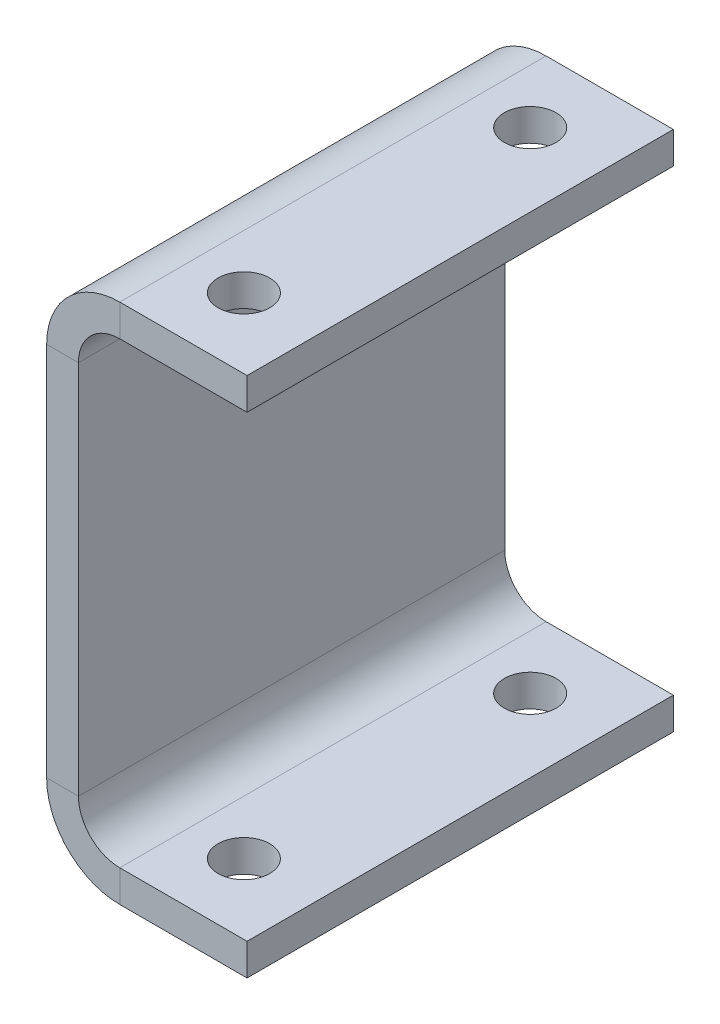
ISO-10303-21;
HEADER;
FILE_DESCRIPTION(('STEP AP214'),'2;1');
FILE_NAME('part.step','',(''),(''),'','','');
FILE_SCHEMA(('AUTOMOTIVE_DESIGN { 1 0 10303 214 1 1 1 1 }'));
ENDSEC;
DATA;
#1=APPLICATION_CONTEXT('core data for automotive mechanical design processes');
#2=APPLICATION_PROTOCOL_DEFINITION('international standard','automotive_design',2000,#1);
#3=PRODUCT_CONTEXT('',#1,'mechanical');
#4=PRODUCT('Part','Part','',(#3));
#5=PRODUCT_RELATED_PRODUCT_CATEGORY('part','',(#4));
#6=PRODUCT_DEFINITION_FORMATION('','',#4);
#7=PRODUCT_DEFINITION_CONTEXT('part definition',#1,'design');
#8=PRODUCT_DEFINITION('design','',#6,#7);
#9=PRODUCT_DEFINITION_SHAPE('','',#8);
#10=(LENGTH_UNIT() NAMED_UNIT(*) SI_UNIT(.MILLI.,.METRE.));
#11=(NAMED_UNIT(*) PLANE_ANGLE_UNIT() SI_UNIT($,.RADIAN.));
#12=(NAMED_UNIT(*) SI_UNIT($,.STERADIAN.) SOLID_ANGLE_UNIT());
#13=UNCERTAINTY_MEASURE_WITH_UNIT(LENGTH_MEASURE(1.E-05),#10,'distance_accuracy_value','');
#14=(GEOMETRIC_REPRESENTATION_CONTEXT(3) GLOBAL_UNCERTAINTY_ASSIGNED_CONTEXT((#13)) GLOBAL_UNIT_ASSIGNED_CONTEXT((#10,
#11,#12)) REPRESENTATION_CONTEXT('',''));
#15=CARTESIAN_POINT('',(0.,0.,0.));
#16=DIRECTION('',(0.,0.,1.));
#17=DIRECTION('',(1.,0.,0.));
#18=AXIS2_PLACEMENT_3D('',#15,#16,#17);
#19=CARTESIAN_POINT('',(0.,-59.,67.));
#20=DIRECTION('',(0.,0.,1.));
#21=DIRECTION('',(1.,0.,0.));
#22=AXIS2_PLACEMENT_3D('',#19,#20,#21);
#23=PLANE('',#22);
#24=DIRECTION('',(1.,0.,0.));
#25=VECTOR('',#24,1.);
#26=CARTESIAN_POINT('',(0.,-59.,67.));
#27=LINE('',#26,#25);
#28=CARTESIAN_POINT('',(0.,-59.,67.));
#29=VERTEX_POINT('',#28);
#30=CARTESIAN_POINT('',(10.,-59.,67.));
#31=VERTEX_POINT('',#30);
#32=EDGE_CURVE('E11',#29,#31,#27,.T.);
#33=ORIENTED_EDGE('',*,*,#32,.F.);
#34=CARTESIAN_POINT('',(23.,-59.,67.));
#35=DIRECTION('',(0.,0.,1.));
#36=DIRECTION('',(1.,0.,0.));
#37=AXIS2_PLACEMENT_3D('',#34,#35,#36);
#38=CIRCLE('',#37,23.);
#39=CARTESIAN_POINT('',(23.,-82.,67.));
#40=VERTEX_POINT('',#39);
#41=EDGE_CURVE('E269',#40,#29,#38,.F.);
#42=ORIENTED_EDGE('',*,*,#41,.F.);
#43=DIRECTION('',(0.,-1.,0.));
#44=VECTOR('',#43,1.);
#45=CARTESIAN_POINT('',(23.,-72.,67.));
#46=LINE('',#45,#44);
#47=CARTESIAN_POINT('',(23.,-72.,67.));
#48=VERTEX_POINT('',#47);
#49=EDGE_CURVE('E48',#48,#40,#46,.T.);
#50=ORIENTED_EDGE('',*,*,#49,.F.);
#51=CARTESIAN_POINT('',(23.,-59.,67.));
#52=DIRECTION('',(0.,0.,1.));
#53=DIRECTION('',(1.,0.,0.));
#54=AXIS2_PLACEMENT_3D('',#51,#52,#53);
#55=CIRCLE('',#54,13.);
#56=EDGE_CURVE('E150',#48,#31,#55,.F.);
#57=ORIENTED_EDGE('',*,*,#56,.T.);
#58=EDGE_LOOP('',(#33,#42,#50,#57));
#59=FACE_BOUND('',#58,.T.);
#60=ADVANCED_FACE('F39',(#59),#23,.T.);
#61=CARTESIAN_POINT('',(23.,-72.,67.));
#62=DIRECTION('',(0.,0.,1.));
#63=DIRECTION('',(1.,0.,0.));
#64=AXIS2_PLACEMENT_3D('',#61,#62,#63);
#65=PLANE('',#64);
#66=DIRECTION('',(0.,1.,0.));
#67=VECTOR('',#66,1.);
#68=CARTESIAN_POINT('',(0.,82.,67.));
#69=LINE('',#68,#67);
#70=CARTESIAN_POINT('',(0.,59.,67.));
#71=VERTEX_POINT('',#70);
#72=EDGE_CURVE('E144',#29,#71,#69,.T.);
#73=ORIENTED_EDGE('',*,*,#72,.F.);
#74=ORIENTED_EDGE('',*,*,#32,.T.);
#75=DIRECTION('',(0.,1.,0.));
#76=VECTOR('',#75,1.);
#77=CARTESIAN_POINT('',(9.99999999999997,82.,67.));
#78=LINE('',#77,#76);
#79=CARTESIAN_POINT('',(9.99999999999997,59.,67.));
#80=VERTEX_POINT('',#79);
#81=EDGE_CURVE('E141',#31,#80,#78,.T.);
#82=ORIENTED_EDGE('',*,*,#81,.T.);
#83=DIRECTION('',(-1.,0.,0.));
#84=VECTOR('',#83,1.);
#85=CARTESIAN_POINT('',(9.99999999999997,59.,67.));
#86=LINE('',#85,#84);
#87=EDGE_CURVE('E233',#80,#71,#86,.T.);
#88=ORIENTED_EDGE('',*,*,#87,.T.);
#89=EDGE_LOOP('',(#73,#74,#82,#88));
#90=FACE_BOUND('',#89,.T.);
#91=ADVANCED_FACE('F139',(#90),#65,.T.);
#92=CARTESIAN_POINT('',(23.,-82.,-67.));
#93=DIRECTION('',(0.,0.,-1.));
#94=DIRECTION('',(-1.,0.,0.));
#95=AXIS2_PLACEMENT_3D('',#92,#93,#94);
#96=PLANE('',#95);
#97=DIRECTION('',(0.,1.,0.));
#98=VECTOR('',#97,1.);
#99=CARTESIAN_POINT('',(23.,-82.,-67.));
#100=LINE('',#99,#98);
#101=CARTESIAN_POINT('',(23.,-82.,-67.));
#102=VERTEX_POINT('',#101);
#103=CARTESIAN_POINT('',(23.,-72.,-67.));
#104=VERTEX_POINT('',#103);
#105=EDGE_CURVE('E238',#102,#104,#100,.T.);
#106=ORIENTED_EDGE('',*,*,#105,.F.);
#107=CARTESIAN_POINT('',(23.,-59.,-67.));
#108=DIRECTION('',(0.,0.,1.));
#109=DIRECTION('',(1.,0.,0.));
#110=AXIS2_PLACEMENT_3D('',#107,#108,#109);
#111=CIRCLE('',#110,23.);
#112=CARTESIAN_POINT('',(0.,-59.,-67.));
#113=VERTEX_POINT('',#112);
#114=EDGE_CURVE('E190',#102,#113,#111,.F.);
#115=ORIENTED_EDGE('',*,*,#114,.T.);
#116=DIRECTION('',(-1.,0.,0.));
#117=VECTOR('',#116,1.);
#118=CARTESIAN_POINT('',(10.,-59.,-67.));
#119=LINE('',#118,#117);
#120=CARTESIAN_POINT('',(10.,-59.,-67.));
#121=VERTEX_POINT('',#120);
#122=EDGE_CURVE('E236',#121,#113,#119,.T.);
#123=ORIENTED_EDGE('',*,*,#122,.F.);
#124=CARTESIAN_POINT('',(23.,-59.,-67.));
#125=DIRECTION('',(0.,0.,1.));
#126=DIRECTION('',(1.,0.,0.));
#127=AXIS2_PLACEMENT_3D('',#124,#125,#126);
#128=CIRCLE('',#127,13.);
#129=EDGE_CURVE('E162',#104,#121,#128,.F.);
#130=ORIENTED_EDGE('',*,*,#129,.F.);
#131=EDGE_LOOP('',(#106,#115,#123,#130));
#132=FACE_BOUND('',#131,.T.);
#133=ADVANCED_FACE('F287',(#132),#96,.T.);
#134=CARTESIAN_POINT('',(10.,-59.,-67.));
#135=DIRECTION('',(0.,0.,-1.));
#136=DIRECTION('',(-1.,0.,0.));
#137=AXIS2_PLACEMENT_3D('',#134,#135,#136);
#138=PLANE('',#137);
#139=DIRECTION('',(-1.,0.,0.));
#140=VECTOR('',#139,1.);
#141=CARTESIAN_POINT('',(0.,-82.,-67.));
#142=LINE('',#141,#140);
#143=CARTESIAN_POINT('',(63.,-82.,-67.));
#144=VERTEX_POINT('',#143);
#145=EDGE_CURVE('E193',#144,#102,#142,.T.);
#146=ORIENTED_EDGE('',*,*,#145,.T.);
#147=ORIENTED_EDGE('',*,*,#105,.T.);
#148=DIRECTION('',(-1.,0.,0.));
#149=VECTOR('',#148,1.);
#150=CARTESIAN_POINT('',(0.,-72.,-67.));
#151=LINE('',#150,#149);
#152=CARTESIAN_POINT('',(63.,-72.,-67.));
#153=VERTEX_POINT('',#152);
#154=EDGE_CURVE('E199',#153,#104,#151,.T.);
#155=ORIENTED_EDGE('',*,*,#154,.F.);
#156=DIRECTION('',(0.,-1.,0.));
#157=VECTOR('',#156,1.);
#158=CARTESIAN_POINT('',(63.,-72.,-67.));
#159=LINE('',#158,#157);
#160=EDGE_CURVE('E196',#153,#144,#159,.T.);
#161=ORIENTED_EDGE('',*,*,#160,.T.);
#162=EDGE_LOOP('',(#146,#147,#155,#161));
#163=FACE_BOUND('',#162,.T.);
#164=ADVANCED_FACE('F335',(#163),#138,.T.);
#165=CARTESIAN_POINT('',(23.,82.,67.));
#166=DIRECTION('',(0.,0.,1.));
#167=DIRECTION('',(1.,0.,0.));
#168=AXIS2_PLACEMENT_3D('',#165,#166,#167);
#169=PLANE('',#168);
#170=DIRECTION('',(0.,-1.,0.));
#171=VECTOR('',#170,1.);
#172=CARTESIAN_POINT('',(23.,82.,67.));
#173=LINE('',#172,#171);
#174=CARTESIAN_POINT('',(23.,82.,67.));
#175=VERTEX_POINT('',#174);
#176=CARTESIAN_POINT('',(23.,72.,67.));
#177=VERTEX_POINT('',#176);
#178=EDGE_CURVE('E57',#175,#177,#173,.T.);
#179=ORIENTED_EDGE('',*,*,#178,.F.);
#180=CARTESIAN_POINT('',(23.,59.,67.));
#181=DIRECTION('',(0.,0.,1.));
#182=DIRECTION('',(1.,0.,0.));
#183=AXIS2_PLACEMENT_3D('',#180,#181,#182);
#184=CIRCLE('',#183,23.);
#185=EDGE_CURVE('E265',#71,#175,#184,.F.);
#186=ORIENTED_EDGE('',*,*,#185,.F.);
#187=ORIENTED_EDGE('',*,*,#87,.F.);
#188=CARTESIAN_POINT('',(23.,59.,67.));
#189=DIRECTION('',(0.,0.,1.));
#190=DIRECTION('',(1.,0.,0.));
#191=AXIS2_PLACEMENT_3D('',#188,#189,#190);
#192=CIRCLE('',#191,13.);
#193=EDGE_CURVE('E170',#80,#177,#192,.F.);
#194=ORIENTED_EDGE('',*,*,#193,.T.);
#195=EDGE_LOOP('',(#179,#186,#187,#194));
#196=FACE_BOUND('',#195,.T.);
#197=ADVANCED_FACE('F340',(#196),#169,.T.);
#198=CARTESIAN_POINT('',(9.99999999999997,59.,67.));
#199=DIRECTION('',(0.,0.,1.));
#200=DIRECTION('',(1.,0.,0.));
#201=AXIS2_PLACEMENT_3D('',#198,#199,#200);
#202=PLANE('',#201);
#203=DIRECTION('',(1.,0.,0.));
#204=VECTOR('',#203,1.);
#205=CARTESIAN_POINT('',(0.,82.,67.));
#206=LINE('',#205,#204);
#207=CARTESIAN_POINT('',(63.,82.,67.));
#208=VERTEX_POINT('',#207);
#209=EDGE_CURVE('E262',#175,#208,#206,.T.);
#210=ORIENTED_EDGE('',*,*,#209,.F.);
#211=ORIENTED_EDGE('',*,*,#178,.T.);
#212=DIRECTION('',(1.,0.,0.));
#213=VECTOR('',#212,1.);
#214=CARTESIAN_POINT('',(0.,72.,67.));
#215=LINE('',#214,#213);
#216=CARTESIAN_POINT('',(63.,72.0000000000001,67.));
#217=VERTEX_POINT('',#216);
#218=EDGE_CURVE('E111',#177,#217,#215,.T.);
#219=ORIENTED_EDGE('',*,*,#218,.T.);
#220=DIRECTION('',(0.,-1.,0.));
#221=VECTOR('',#220,1.);
#222=CARTESIAN_POINT('',(63.,82.,67.));
#223=LINE('',#222,#221);
#224=EDGE_CURVE('E259',#208,#217,#223,.T.);
#225=ORIENTED_EDGE('',*,*,#224,.F.);
#226=EDGE_LOOP('',(#210,#211,#219,#225));
#227=FACE_BOUND('',#226,.T.);
#228=ADVANCED_FACE('F314',(#227),#202,.T.);
#229=CARTESIAN_POINT('',(0.,59.,-67.));
#230=DIRECTION('',(0.,0.,-1.));
#231=DIRECTION('',(-1.,0.,0.));
#232=AXIS2_PLACEMENT_3D('',#229,#230,#231);
#233=PLANE('',#232);
#234=DIRECTION('',(1.,0.,0.));
#235=VECTOR('',#234,1.);
#236=CARTESIAN_POINT('',(0.,59.,-67.));
#237=LINE('',#236,#235);
#238=CARTESIAN_POINT('',(0.,59.,-67.));
#239=VERTEX_POINT('',#238);
#240=CARTESIAN_POINT('',(9.99999999999997,59.,-67.));
#241=VERTEX_POINT('',#240);
#242=EDGE_CURVE('E98',#239,#241,#237,.T.);
#243=ORIENTED_EDGE('',*,*,#242,.F.);
#244=CARTESIAN_POINT('',(23.,59.,-67.));
#245=DIRECTION('',(0.,0.,1.));
#246=DIRECTION('',(1.,0.,0.));
#247=AXIS2_PLACEMENT_3D('',#244,#245,#246);
#248=CIRCLE('',#247,23.);
#249=CARTESIAN_POINT('',(23.,82.,-67.));
#250=VERTEX_POINT('',#249);
#251=EDGE_CURVE('E186',#239,#250,#248,.F.);
#252=ORIENTED_EDGE('',*,*,#251,.T.);
#253=DIRECTION('',(0.,1.,0.));
#254=VECTOR('',#253,1.);
#255=CARTESIAN_POINT('',(23.,72.,-67.));
#256=LINE('',#255,#254);
#257=CARTESIAN_POINT('',(23.,72.,-67.));
#258=VERTEX_POINT('',#257);
#259=EDGE_CURVE('E105',#258,#250,#256,.T.);
#260=ORIENTED_EDGE('',*,*,#259,.F.);
#261=CARTESIAN_POINT('',(23.,59.,-67.));
#262=DIRECTION('',(0.,0.,1.));
#263=DIRECTION('',(1.,0.,0.));
#264=AXIS2_PLACEMENT_3D('',#261,#262,#263);
#265=CIRCLE('',#264,13.);
#266=EDGE_CURVE('E205',#241,#258,#265,.F.);
#267=ORIENTED_EDGE('',*,*,#266,.F.);
#268=EDGE_LOOP('',(#243,#252,#260,#267));
#269=FACE_BOUND('',#268,.T.);
#270=ADVANCED_FACE('F302',(#269),#233,.T.);
#271=CARTESIAN_POINT('',(23.,72.,-67.));
#272=DIRECTION('',(0.,0.,-1.));
#273=DIRECTION('',(-1.,0.,0.));
#274=AXIS2_PLACEMENT_3D('',#271,#272,#273);
#275=PLANE('',#274);
#276=DIRECTION('',(0.,1.,0.));
#277=VECTOR('',#276,1.);
#278=CARTESIAN_POINT('',(0.,82.,-67.));
#279=LINE('',#278,#277);
#280=EDGE_CURVE('E188',#113,#239,#279,.T.);
#281=ORIENTED_EDGE('',*,*,#280,.T.);
#282=ORIENTED_EDGE('',*,*,#242,.T.);
#283=DIRECTION('',(0.,1.,0.));
#284=VECTOR('',#283,1.);
#285=CARTESIAN_POINT('',(9.99999999999997,82.,-67.));
#286=LINE('',#285,#284);
#287=EDGE_CURVE('E203',#121,#241,#286,.T.);
#288=ORIENTED_EDGE('',*,*,#287,.F.);
#289=ORIENTED_EDGE('',*,*,#122,.T.);
#290=EDGE_LOOP('',(#281,#282,#288,#289));
#291=FACE_BOUND('',#290,.T.);
#292=ADVANCED_FACE('F289',(#291),#275,.T.);
#293=CARTESIAN_POINT('',(0.,72.,67.));
#294=DIRECTION('',(0.,1.,0.));
#295=DIRECTION('',(-1.,0.,0.));
#296=AXIS2_PLACEMENT_3D('',#293,#294,#295);
#297=PLANE('',#296);
#298=CARTESIAN_POINT('',(39.9999999999999,72.,45.));
#299=DIRECTION('',(0.,1.,0.));
#300=DIRECTION('',(-1.,0.,0.));
#301=AXIS2_PLACEMENT_3D('',#298,#299,#300);
#302=CIRCLE('',#301,8.125);
#303=CARTESIAN_POINT('',(31.8749999999999,72.,45.));
#304=VERTEX_POINT('',#303);
#305=EDGE_CURVE('E253',#304,#304,#302,.T.);
#306=ORIENTED_EDGE('',*,*,#305,.T.);
#307=EDGE_LOOP('',(#306));
#308=FACE_BOUND('',#307,.T.);
#309=CARTESIAN_POINT('',(39.9999999999999,72.,-45.));
#310=DIRECTION('',(0.,1.,0.));
#311=DIRECTION('',(-1.,0.,0.));
#312=AXIS2_PLACEMENT_3D('',#309,#310,#311);
#313=CIRCLE('',#312,8.125);
#314=CARTESIAN_POINT('',(31.8749999999999,72.,-45.));
#315=VERTEX_POINT('',#314);
#316=EDGE_CURVE('E180',#315,#315,#313,.T.);
#317=ORIENTED_EDGE('',*,*,#316,.T.);
#318=EDGE_LOOP('',(#317));
#319=FACE_BOUND('',#318,.T.);
#320=DIRECTION('',(1.,0.,0.));
#321=VECTOR('',#320,1.);
#322=CARTESIAN_POINT('',(0.,72.,-67.));
#323=LINE('',#322,#321);
#324=CARTESIAN_POINT('',(63.,72.0000000000001,-67.));
#325=VERTEX_POINT('',#324);
#326=EDGE_CURVE('E176',#258,#325,#323,.T.);
#327=ORIENTED_EDGE('',*,*,#326,.T.);
#328=DIRECTION('',(0.,0.,-1.));
#329=VECTOR('',#328,1.);
#330=CARTESIAN_POINT('',(63.,72.0000000000001,67.));
#331=LINE('',#330,#329);
#332=EDGE_CURVE('E229',#217,#325,#331,.T.);
#333=ORIENTED_EDGE('',*,*,#332,.F.);
#334=ORIENTED_EDGE('',*,*,#218,.F.);
#335=DIRECTION('',(0.,0.,-1.));
#336=VECTOR('',#335,1.);
#337=CARTESIAN_POINT('',(23.,72.,67.));
#338=LINE('',#337,#336);
#339=EDGE_CURVE('E172',#177,#258,#338,.T.);
#340=ORIENTED_EDGE('',*,*,#339,.T.);
#341=EDGE_LOOP('',(#327,#333,#334,#340));
#342=FACE_BOUND('',#341,.T.);
#343=ADVANCED_FACE('F308',(#308,#319,#342),#297,.F.);
#344=CARTESIAN_POINT('',(63.,82.,67.));
#345=DIRECTION('',(1.,0.,0.));
#346=DIRECTION('',(0.,0.,-1.));
#347=AXIS2_PLACEMENT_3D('',#344,#345,#346);
#348=PLANE('',#347);
#349=DIRECTION('',(0.,-1.,0.));
#350=VECTOR('',#349,1.);
#351=CARTESIAN_POINT('',(63.,82.,-67.));
#352=LINE('',#351,#350);
#353=CARTESIAN_POINT('',(63.,82.,-67.));
#354=VERTEX_POINT('',#353);
#355=EDGE_CURVE('E179',#354,#325,#352,.T.);
#356=ORIENTED_EDGE('',*,*,#355,.F.);
#357=DIRECTION('',(0.,0.,-1.));
#358=VECTOR('',#357,1.);
#359=CARTESIAN_POINT('',(63.,82.,67.));
#360=LINE('',#359,#358);
#361=EDGE_CURVE('E227',#208,#354,#360,.T.);
#362=ORIENTED_EDGE('',*,*,#361,.F.);
#363=ORIENTED_EDGE('',*,*,#224,.T.);
#364=ORIENTED_EDGE('',*,*,#332,.T.);
#365=EDGE_LOOP('',(#356,#362,#363,#364));
#366=FACE_BOUND('',#365,.T.);
#367=ADVANCED_FACE('F313',(#366),#348,.T.);
#368=CARTESIAN_POINT('',(0.,82.,67.));
#369=DIRECTION('',(0.,1.,0.));
#370=DIRECTION('',(-1.,0.,0.));
#371=AXIS2_PLACEMENT_3D('',#368,#369,#370);
#372=PLANE('',#371);
#373=CARTESIAN_POINT('',(39.9999999999999,82.,45.));
#374=DIRECTION('',(0.,1.,0.));
#375=DIRECTION('',(-1.,0.,0.));
#376=AXIS2_PLACEMENT_3D('',#373,#374,#375);
#377=CIRCLE('',#376,8.125);
#378=CARTESIAN_POINT('',(31.8749999999999,82.,45.));
#379=VERTEX_POINT('',#378);
#380=EDGE_CURVE('E601',#379,#379,#377,.T.);
#381=ORIENTED_EDGE('',*,*,#380,.F.);
#382=EDGE_LOOP('',(#381));
#383=FACE_BOUND('',#382,.T.);
#384=CARTESIAN_POINT('',(39.9999999999999,82.,-45.));
#385=DIRECTION('',(0.,1.,0.));
#386=DIRECTION('',(-1.,0.,0.));
#387=AXIS2_PLACEMENT_3D('',#384,#385,#386);
#388=CIRCLE('',#387,8.125);
#389=CARTESIAN_POINT('',(31.8749999999999,82.,-45.));
#390=VERTEX_POINT('',#389);
#391=EDGE_CURVE('E248',#390,#390,#388,.T.);
#392=ORIENTED_EDGE('',*,*,#391,.F.);
#393=EDGE_LOOP('',(#392));
#394=FACE_BOUND('',#393,.T.);
#395=DIRECTION('',(1.,0.,0.));
#396=VECTOR('',#395,1.);
#397=CARTESIAN_POINT('',(0.,82.,-67.));
#398=LINE('',#397,#396);
#399=EDGE_CURVE('E183',#250,#354,#398,.T.);
#400=ORIENTED_EDGE('',*,*,#399,.F.);
#401=DIRECTION('',(0.,0.,-1.));
#402=VECTOR('',#401,1.);
#403=CARTESIAN_POINT('',(23.,82.,67.));
#404=LINE('',#403,#402);
#405=EDGE_CURVE('E224',#175,#250,#404,.T.);
#406=ORIENTED_EDGE('',*,*,#405,.F.);
#407=ORIENTED_EDGE('',*,*,#209,.T.);
#408=ORIENTED_EDGE('',*,*,#361,.T.);
#409=EDGE_LOOP('',(#400,#406,#407,#408));
#410=FACE_BOUND('',#409,.T.);
#411=ADVANCED_FACE('F316',(#383,#394,#410),#372,.T.);
#412=CARTESIAN_POINT('',(23.,59.,67.));
#413=DIRECTION('',(0.,0.,-1.));
#414=DIRECTION('',(-1.,0.,0.));
#415=AXIS2_PLACEMENT_3D('',#412,#413,#414);
#416=CYLINDRICAL_SURFACE('',#415,23.);
#417=ORIENTED_EDGE('',*,*,#251,.F.);
#418=DIRECTION('',(0.,0.,-1.));
#419=VECTOR('',#418,1.);
#420=CARTESIAN_POINT('',(0.,59.,67.));
#421=LINE('',#420,#419);
#422=EDGE_CURVE('E221',#71,#239,#421,.T.);
#423=ORIENTED_EDGE('',*,*,#422,.F.);
#424=ORIENTED_EDGE('',*,*,#185,.T.);
#425=ORIENTED_EDGE('',*,*,#405,.T.);
#426=EDGE_LOOP('',(#417,#423,#424,#425));
#427=FACE_BOUND('',#426,.T.);
#428=ADVANCED_FACE('F299',(#427),#416,.T.);
#429=CARTESIAN_POINT('',(0.,82.,67.));
#430=DIRECTION('',(-1.,0.,0.));
#431=DIRECTION('',(0.,-1.,0.));
#432=AXIS2_PLACEMENT_3D('',#429,#430,#431);
#433=PLANE('',#432);
#434=ORIENTED_EDGE('',*,*,#280,.F.);
#435=DIRECTION('',(0.,0.,-1.));
#436=VECTOR('',#435,1.);
#437=CARTESIAN_POINT('',(0.,-59.,67.));
#438=LINE('',#437,#436);
#439=EDGE_CURVE('E218',#29,#113,#438,.T.);
#440=ORIENTED_EDGE('',*,*,#439,.F.);
#441=ORIENTED_EDGE('',*,*,#72,.T.);
#442=ORIENTED_EDGE('',*,*,#422,.T.);
#443=EDGE_LOOP('',(#434,#440,#441,#442));
#444=FACE_BOUND('',#443,.T.);
#445=ADVANCED_FACE('F294',(#444),#433,.T.);
#446=CARTESIAN_POINT('',(23.,-59.,67.));
#447=DIRECTION('',(0.,0.,-1.));
#448=DIRECTION('',(-1.,0.,0.));
#449=AXIS2_PLACEMENT_3D('',#446,#447,#448);
#450=CYLINDRICAL_SURFACE('',#449,23.);
#451=ORIENTED_EDGE('',*,*,#114,.F.);
#452=DIRECTION('',(0.,0.,-1.));
#453=VECTOR('',#452,1.);
#454=CARTESIAN_POINT('',(23.,-82.,67.));
#455=LINE('',#454,#453);
#456=EDGE_CURVE('E215',#40,#102,#455,.T.);
#457=ORIENTED_EDGE('',*,*,#456,.F.);
#458=ORIENTED_EDGE('',*,*,#41,.T.);
#459=ORIENTED_EDGE('',*,*,#439,.T.);
#460=EDGE_LOOP('',(#451,#457,#458,#459));
#461=FACE_BOUND('',#460,.T.);
#462=ADVANCED_FACE('F292',(#461),#450,.T.);
#463=CARTESIAN_POINT('',(0.,-82.,67.));
#464=DIRECTION('',(0.,-1.,0.));
#465=DIRECTION('',(1.,0.,0.));
#466=AXIS2_PLACEMENT_3D('',#463,#464,#465);
#467=PLANE('',#466);
#468=CARTESIAN_POINT('',(40.,-82.,45.));
#469=DIRECTION('',(0.,1.,0.));
#470=DIRECTION('',(-1.,0.,0.));
#471=AXIS2_PLACEMENT_3D('',#468,#469,#470);
#472=CIRCLE('',#471,8.125);
#473=CARTESIAN_POINT('',(31.875,-82.,45.));
#474=VERTEX_POINT('',#473);
#475=EDGE_CURVE('E603',#474,#474,#472,.T.);
#476=ORIENTED_EDGE('',*,*,#475,.T.);
#477=EDGE_LOOP('',(#476));
#478=FACE_BOUND('',#477,.T.);
#479=CARTESIAN_POINT('',(40.,-82.,-45.));
#480=DIRECTION('',(0.,1.,0.));
#481=DIRECTION('',(-1.,0.,0.));
#482=AXIS2_PLACEMENT_3D('',#479,#480,#481);
#483=CIRCLE('',#482,8.125);
#484=CARTESIAN_POINT('',(31.875,-82.,-45.));
#485=VERTEX_POINT('',#484);
#486=EDGE_CURVE('E242',#485,#485,#483,.T.);
#487=ORIENTED_EDGE('',*,*,#486,.T.);
#488=EDGE_LOOP('',(#487));
#489=FACE_BOUND('',#488,.T.);
#490=ORIENTED_EDGE('',*,*,#145,.F.);
#491=DIRECTION('',(0.,0.,-1.));
#492=VECTOR('',#491,1.);
#493=CARTESIAN_POINT('',(63.,-82.,67.));
#494=LINE('',#493,#492);
#495=CARTESIAN_POINT('',(63.,-82.,67.));
#496=VERTEX_POINT('',#495);
#497=EDGE_CURVE('E213',#496,#144,#494,.T.);
#498=ORIENTED_EDGE('',*,*,#497,.F.);
#499=DIRECTION('',(-1.,0.,0.));
#500=VECTOR('',#499,1.);
#501=CARTESIAN_POINT('',(0.,-82.,67.));
#502=LINE('',#501,#500);
#503=EDGE_CURVE('E271',#496,#40,#502,.T.);
#504=ORIENTED_EDGE('',*,*,#503,.T.);
#505=ORIENTED_EDGE('',*,*,#456,.T.);
#506=EDGE_LOOP('',(#490,#498,#504,#505));
#507=FACE_BOUND('',#506,.T.);
#508=ADVANCED_FACE('F391',(#478,#489,#507),#467,.T.);
#509=CARTESIAN_POINT('',(63.,-72.,67.));
#510=DIRECTION('',(1.,0.,0.));
#511=DIRECTION('',(0.,0.,-1.));
#512=AXIS2_PLACEMENT_3D('',#509,#510,#511);
#513=PLANE('',#512);
#514=ORIENTED_EDGE('',*,*,#160,.F.);
#515=DIRECTION('',(0.,0.,-1.));
#516=VECTOR('',#515,1.);
#517=CARTESIAN_POINT('',(63.,-72.,67.));
#518=LINE('',#517,#516);
#519=CARTESIAN_POINT('',(63.,-72.,67.));
#520=VERTEX_POINT('',#519);
#521=EDGE_CURVE('E211',#520,#153,#518,.T.);
#522=ORIENTED_EDGE('',*,*,#521,.F.);
#523=DIRECTION('',(0.,-1.,0.));
#524=VECTOR('',#523,1.);
#525=CARTESIAN_POINT('',(63.,-72.,67.));
#526=LINE('',#525,#524);
#527=EDGE_CURVE('E274',#520,#496,#526,.T.);
#528=ORIENTED_EDGE('',*,*,#527,.T.);
#529=ORIENTED_EDGE('',*,*,#497,.T.);
#530=EDGE_LOOP('',(#514,#522,#528,#529));
#531=FACE_BOUND('',#530,.T.);
#532=ADVANCED_FACE('F387',(#531),#513,.T.);
#533=CARTESIAN_POINT('',(0.,-72.,67.));
#534=DIRECTION('',(0.,-1.,0.));
#535=DIRECTION('',(1.,0.,0.));
#536=AXIS2_PLACEMENT_3D('',#533,#534,#535);
#537=PLANE('',#536);
#538=CARTESIAN_POINT('',(40.,-72.,45.));
#539=DIRECTION('',(0.,-1.,0.));
#540=DIRECTION('',(1.,0.,0.));
#541=AXIS2_PLACEMENT_3D('',#538,#539,#540);
#542=CIRCLE('',#541,8.125);
#543=CARTESIAN_POINT('',(48.125,-72.,45.));
#544=VERTEX_POINT('',#543);
#545=EDGE_CURVE('E42',#544,#544,#542,.T.);
#546=ORIENTED_EDGE('',*,*,#545,.T.);
#547=EDGE_LOOP('',(#546));
#548=FACE_BOUND('',#547,.T.);
#549=CARTESIAN_POINT('',(40.,-72.,-45.));
#550=DIRECTION('',(0.,-1.,0.));
#551=DIRECTION('',(1.,0.,0.));
#552=AXIS2_PLACEMENT_3D('',#549,#550,#551);
#553=CIRCLE('',#552,8.125);
#554=CARTESIAN_POINT('',(48.125,-72.,-45.));
#555=VERTEX_POINT('',#554);
#556=EDGE_CURVE('E240',#555,#555,#553,.T.);
#557=ORIENTED_EDGE('',*,*,#556,.T.);
#558=EDGE_LOOP('',(#557));
#559=FACE_BOUND('',#558,.T.);
#560=ORIENTED_EDGE('',*,*,#154,.T.);
#561=DIRECTION('',(0.,0.,-1.));
#562=VECTOR('',#561,1.);
#563=CARTESIAN_POINT('',(23.,-72.,67.));
#564=LINE('',#563,#562);
#565=EDGE_CURVE('E164',#48,#104,#564,.T.);
#566=ORIENTED_EDGE('',*,*,#565,.F.);
#567=DIRECTION('',(-1.,0.,0.));
#568=VECTOR('',#567,1.);
#569=CARTESIAN_POINT('',(0.,-72.,67.));
#570=LINE('',#569,#568);
#571=EDGE_CURVE('E155',#520,#48,#570,.T.);
#572=ORIENTED_EDGE('',*,*,#571,.F.);
#573=ORIENTED_EDGE('',*,*,#521,.T.);
#574=EDGE_LOOP('',(#560,#566,#572,#573));
#575=FACE_BOUND('',#574,.T.);
#576=ADVANCED_FACE('F284',(#548,#559,#575),#537,.F.);
#577=CARTESIAN_POINT('',(23.,-59.,67.));
#578=DIRECTION('',(0.,0.,-1.));
#579=DIRECTION('',(-1.,0.,0.));
#580=AXIS2_PLACEMENT_3D('',#577,#578,#579);
#581=CYLINDRICAL_SURFACE('',#580,13.);
#582=ORIENTED_EDGE('',*,*,#129,.T.);
#583=DIRECTION('',(0.,0.,-1.));
#584=VECTOR('',#583,1.);
#585=CARTESIAN_POINT('',(10.,-59.,67.));
#586=LINE('',#585,#584);
#587=EDGE_CURVE('E159',#31,#121,#586,.T.);
#588=ORIENTED_EDGE('',*,*,#587,.F.);
#589=ORIENTED_EDGE('',*,*,#56,.F.);
#590=ORIENTED_EDGE('',*,*,#565,.T.);
#591=EDGE_LOOP('',(#582,#588,#589,#590));
#592=FACE_BOUND('',#591,.T.);
#593=ADVANCED_FACE('F160',(#592),#581,.F.);
#594=CARTESIAN_POINT('',(9.99999999999997,82.,67.));
#595=DIRECTION('',(-1.,0.,0.));
#596=DIRECTION('',(0.,-1.,0.));
#597=AXIS2_PLACEMENT_3D('',#594,#595,#596);
#598=PLANE('',#597);
#599=ORIENTED_EDGE('',*,*,#287,.T.);
#600=DIRECTION('',(0.,0.,-1.));
#601=VECTOR('',#600,1.);
#602=CARTESIAN_POINT('',(9.99999999999997,59.,67.));
#603=LINE('',#602,#601);
#604=EDGE_CURVE('E165',#80,#241,#603,.T.);
#605=ORIENTED_EDGE('',*,*,#604,.F.);
#606=ORIENTED_EDGE('',*,*,#81,.F.);
#607=ORIENTED_EDGE('',*,*,#587,.T.);
#608=EDGE_LOOP('',(#599,#605,#606,#607));
#609=FACE_BOUND('',#608,.T.);
#610=ADVANCED_FACE('F167',(#609),#598,.F.);
#611=CARTESIAN_POINT('',(23.,59.,67.));
#612=DIRECTION('',(0.,0.,-1.));
#613=DIRECTION('',(-1.,0.,0.));
#614=AXIS2_PLACEMENT_3D('',#611,#612,#613);
#615=CYLINDRICAL_SURFACE('',#614,13.);
#616=ORIENTED_EDGE('',*,*,#266,.T.);
#617=ORIENTED_EDGE('',*,*,#339,.F.);
#618=ORIENTED_EDGE('',*,*,#193,.F.);
#619=ORIENTED_EDGE('',*,*,#604,.T.);
#620=EDGE_LOOP('',(#616,#617,#618,#619));
#621=FACE_BOUND('',#620,.T.);
#622=ADVANCED_FACE('F305',(#621),#615,.F.);
#623=CARTESIAN_POINT('',(23.,59.,67.));
#624=DIRECTION('',(0.,0.,1.));
#625=DIRECTION('',(1.,0.,0.));
#626=AXIS2_PLACEMENT_3D('',#623,#624,#625);
#627=PLANE('',#626);
#628=ORIENTED_EDGE('',*,*,#571,.T.);
#629=ORIENTED_EDGE('',*,*,#49,.T.);
#630=ORIENTED_EDGE('',*,*,#503,.F.);
#631=ORIENTED_EDGE('',*,*,#527,.F.);
#632=EDGE_LOOP('',(#628,#629,#630,#631));
#633=FACE_BOUND('',#632,.T.);
#634=ADVANCED_FACE('F280',(#633),#627,.T.);
#635=CARTESIAN_POINT('',(23.,59.,-67.));
#636=DIRECTION('',(0.,0.,1.));
#637=DIRECTION('',(1.,0.,0.));
#638=AXIS2_PLACEMENT_3D('',#635,#636,#637);
#639=PLANE('',#638);
#640=ORIENTED_EDGE('',*,*,#326,.F.);
#641=ORIENTED_EDGE('',*,*,#259,.T.);
#642=ORIENTED_EDGE('',*,*,#399,.T.);
#643=ORIENTED_EDGE('',*,*,#355,.T.);
#644=EDGE_LOOP('',(#640,#641,#642,#643));
#645=FACE_BOUND('',#644,.T.);
#646=ADVANCED_FACE('F310',(#645),#639,.F.);
#647=CARTESIAN_POINT('',(40.,-82.,-45.));
#648=DIRECTION('',(0.,1.,0.));
#649=DIRECTION('',(-1.,0.,0.));
#650=AXIS2_PLACEMENT_3D('',#647,#648,#649);
#651=CYLINDRICAL_SURFACE('',#650,8.125);
#652=ORIENTED_EDGE('',*,*,#486,.F.);
#653=EDGE_LOOP('',(#652));
#654=FACE_BOUND('',#653,.T.);
#655=ORIENTED_EDGE('',*,*,#556,.F.);
#656=EDGE_LOOP('',(#655));
#657=FACE_BOUND('',#656,.T.);
#658=ADVANCED_FACE('F363',(#654,#657),#651,.F.);
#659=ORIENTED_EDGE('',*,*,#391,.T.);
#660=EDGE_LOOP('',(#659));
#661=FACE_BOUND('',#660,.T.);
#662=ORIENTED_EDGE('',*,*,#316,.F.);
#663=EDGE_LOOP('',(#662));
#664=FACE_BOUND('',#663,.T.);
#665=ADVANCED_FACE('F360',(#661,#664),#651,.F.);
#666=CARTESIAN_POINT('',(40.,-82.,45.));
#667=DIRECTION('',(0.,1.,0.));
#668=DIRECTION('',(-1.,0.,0.));
#669=AXIS2_PLACEMENT_3D('',#666,#667,#668);
#670=CYLINDRICAL_SURFACE('',#669,8.125);
#671=ORIENTED_EDGE('',*,*,#475,.F.);
#672=EDGE_LOOP('',(#671));
#673=FACE_BOUND('',#672,.T.);
#674=ORIENTED_EDGE('',*,*,#545,.F.);
#675=EDGE_LOOP('',(#674));
#676=FACE_BOUND('',#675,.T.);
#677=ADVANCED_FACE('F362',(#673,#676),#670,.F.);
#678=ORIENTED_EDGE('',*,*,#380,.T.);
#679=EDGE_LOOP('',(#678));
#680=FACE_BOUND('',#679,.T.);
#681=ORIENTED_EDGE('',*,*,#305,.F.);
#682=EDGE_LOOP('',(#681));
#683=FACE_BOUND('',#682,.T.);
#684=ADVANCED_FACE('F370',(#680,#683),#670,.F.);
#685=CLOSED_SHELL('',(#60,#91,#133,#164,#197,#228,#270,#292,#343,#367,#411,#428,#445,#462,#508,
#532,#576,#593,#610,#622,#634,#646,#658,#665,#677,#684));
#686=MANIFOLD_SOLID_BREP('B2',#685);
#687=ADVANCED_BREP_SHAPE_REPRESENTATION('',(#18,#686),#14);
#688=SHAPE_DEFINITION_REPRESENTATION(#9,#687);
ENDSEC;
END-ISO-10303-21;
